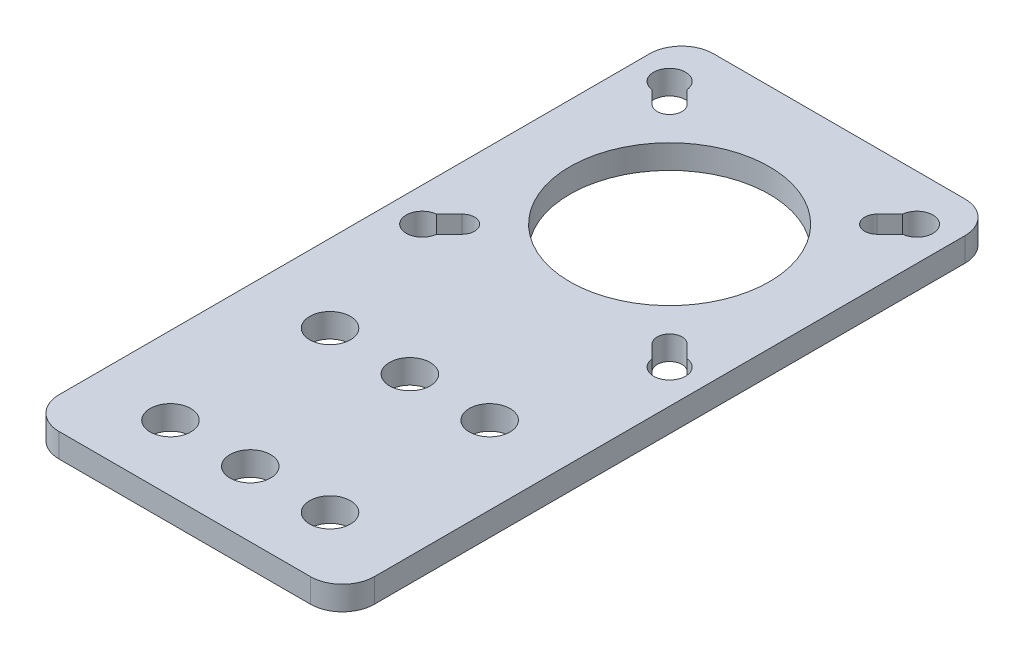
ISO-10303-21;
HEADER;
FILE_DESCRIPTION(('STEP AP214'),'2;1');
FILE_NAME('part.step','',(''),(''),'','','');
FILE_SCHEMA(('AUTOMOTIVE_DESIGN { 1 0 10303 214 1 1 1 1 }'));
ENDSEC;
DATA;
#1=APPLICATION_CONTEXT('core data for automotive mechanical design processes');
#2=APPLICATION_PROTOCOL_DEFINITION('international standard','automotive_design',2000,#1);
#3=PRODUCT_CONTEXT('',#1,'mechanical');
#4=PRODUCT('Part','Part','',(#3));
#5=PRODUCT_RELATED_PRODUCT_CATEGORY('part','',(#4));
#6=PRODUCT_DEFINITION_FORMATION('','',#4);
#7=PRODUCT_DEFINITION_CONTEXT('part definition',#1,'design');
#8=PRODUCT_DEFINITION('design','',#6,#7);
#9=PRODUCT_DEFINITION_SHAPE('','',#8);
#10=(LENGTH_UNIT() NAMED_UNIT(*) SI_UNIT(.MILLI.,.METRE.));
#11=(NAMED_UNIT(*) PLANE_ANGLE_UNIT() SI_UNIT($,.RADIAN.));
#12=(NAMED_UNIT(*) SI_UNIT($,.STERADIAN.) SOLID_ANGLE_UNIT());
#13=UNCERTAINTY_MEASURE_WITH_UNIT(LENGTH_MEASURE(1.E-05),#10,'distance_accuracy_value','');
#14=(GEOMETRIC_REPRESENTATION_CONTEXT(3) GLOBAL_UNCERTAINTY_ASSIGNED_CONTEXT((#13)) GLOBAL_UNIT_ASSIGNED_CONTEXT((#10,
#11,#12)) REPRESENTATION_CONTEXT('',''));
#15=CARTESIAN_POINT('',(0.,0.,0.));
#16=DIRECTION('',(0.,0.,1.));
#17=DIRECTION('',(1.,0.,0.));
#18=AXIS2_PLACEMENT_3D('',#15,#16,#17);
#19=CARTESIAN_POINT('',(-15.75,3.,56.75));
#20=DIRECTION('',(0.,-1.,0.));
#21=DIRECTION('',(0.,0.,-1.));
#22=AXIS2_PLACEMENT_3D('',#19,#20,#21);
#23=PLANE('',#22);
#24=DIRECTION('',(0.707106781186545,0.,-0.70710678118655));
#25=VECTOR('',#24,1.);
#26=CARTESIAN_POINT('',(-11.9039844891608,3.,14.0960155108391));
#27=LINE('',#26,#25);
#28=CARTESIAN_POINT('',(-13.5102563425748,3.,15.7022873642532));
#29=VERTEX_POINT('',#28);
#30=CARTESIAN_POINT('',(-11.9039844891608,3.,14.0960155108391));
#31=VERTEX_POINT('',#30);
#32=EDGE_CURVE('E248',#29,#31,#27,.T.);
#33=ORIENTED_EDGE('',*,*,#32,.F.);
#34=CARTESIAN_POINT('',(-15.4999999999999,3.,15.5));
#35=DIRECTION('',(0.,1.,0.));
#36=DIRECTION('',(0.,0.,1.));
#37=AXIS2_PLACEMENT_3D('',#34,#35,#36);
#38=CIRCLE('',#37,2.);
#39=CARTESIAN_POINT('',(-15.7022873642531,3.,13.5102563425749));
#40=VERTEX_POINT('',#39);
#41=EDGE_CURVE('E68',#40,#29,#38,.T.);
#42=ORIENTED_EDGE('',*,*,#41,.F.);
#43=DIRECTION('',(-0.707106781186545,0.,0.70710678118655));
#44=VECTOR('',#43,1.);
#45=CARTESIAN_POINT('',(-14.0960155108391,3.,11.9039844891609));
#46=LINE('',#45,#44);
#47=CARTESIAN_POINT('',(-14.0960155108391,3.,11.9039844891609));
#48=VERTEX_POINT('',#47);
#49=EDGE_CURVE('E244',#48,#40,#46,.T.);
#50=ORIENTED_EDGE('',*,*,#49,.F.);
#51=CARTESIAN_POINT('',(-12.9999999999999,3.,13.));
#52=DIRECTION('',(0.,1.,0.));
#53=DIRECTION('',(0.,0.,1.));
#54=AXIS2_PLACEMENT_3D('',#51,#52,#53);
#55=CIRCLE('',#54,1.55);
#56=EDGE_CURVE('E242',#31,#48,#55,.T.);
#57=ORIENTED_EDGE('',*,*,#56,.F.);
#58=EDGE_LOOP('',(#33,#42,#50,#57));
#59=FACE_BOUND('',#58,.T.);
#60=CARTESIAN_POINT('',(-9.99999999999999,3.,32.55));
#61=DIRECTION('',(0.,1.,0.));
#62=DIRECTION('',(0.,0.,1.));
#63=AXIS2_PLACEMENT_3D('',#60,#61,#62);
#64=CIRCLE('',#63,2.55);
#65=CARTESIAN_POINT('',(-9.99999999999999,3.,35.1));
#66=VERTEX_POINT('',#65);
#67=EDGE_CURVE('E284',#66,#66,#64,.T.);
#68=ORIENTED_EDGE('',*,*,#67,.F.);
#69=EDGE_LOOP('',(#68));
#70=FACE_BOUND('',#69,.T.);
#71=CARTESIAN_POINT('',(0.,3.,32.55));
#72=DIRECTION('',(0.,1.,0.));
#73=DIRECTION('',(0.,0.,1.));
#74=AXIS2_PLACEMENT_3D('',#71,#72,#73);
#75=CIRCLE('',#74,2.55);
#76=CARTESIAN_POINT('',(0.,3.,35.1));
#77=VERTEX_POINT('',#76);
#78=EDGE_CURVE('E296',#77,#77,#75,.T.);
#79=ORIENTED_EDGE('',*,*,#78,.F.);
#80=EDGE_LOOP('',(#79));
#81=FACE_BOUND('',#80,.T.);
#82=CARTESIAN_POINT('',(10.,3.,32.55));
#83=DIRECTION('',(0.,1.,0.));
#84=DIRECTION('',(0.,0.,1.));
#85=AXIS2_PLACEMENT_3D('',#82,#83,#84);
#86=CIRCLE('',#85,2.55);
#87=CARTESIAN_POINT('',(10.,3.,35.1));
#88=VERTEX_POINT('',#87);
#89=EDGE_CURVE('E308',#88,#88,#86,.T.);
#90=ORIENTED_EDGE('',*,*,#89,.F.);
#91=EDGE_LOOP('',(#90));
#92=FACE_BOUND('',#91,.T.);
#93=DIRECTION('',(-0.707106781186545,0.,0.70710678118655));
#94=VECTOR('',#93,1.);
#95=CARTESIAN_POINT('',(11.9039844891608,3.,-14.0960155108391));
#96=LINE('',#95,#94);
#97=CARTESIAN_POINT('',(13.5102563425748,3.,-15.7022873642532));
#98=VERTEX_POINT('',#97);
#99=CARTESIAN_POINT('',(11.9039844891608,3.,-14.0960155108391));
#100=VERTEX_POINT('',#99);
#101=EDGE_CURVE('E326',#98,#100,#96,.T.);
#102=ORIENTED_EDGE('',*,*,#101,.F.);
#103=CARTESIAN_POINT('',(15.4999999999999,3.,-15.5));
#104=DIRECTION('',(0.,1.,0.));
#105=DIRECTION('',(0.,0.,1.));
#106=AXIS2_PLACEMENT_3D('',#103,#104,#105);
#107=CIRCLE('',#106,2.);
#108=CARTESIAN_POINT('',(15.7022873642531,3.,-13.5102563425749));
#109=VERTEX_POINT('',#108);
#110=EDGE_CURVE('E431',#109,#98,#107,.T.);
#111=ORIENTED_EDGE('',*,*,#110,.F.);
#112=DIRECTION('',(0.707106781186546,0.,-0.707106781186549));
#113=VECTOR('',#112,1.);
#114=CARTESIAN_POINT('',(14.0960155108391,3.,-11.9039844891608));
#115=LINE('',#114,#113);
#116=CARTESIAN_POINT('',(14.0960155108391,3.,-11.9039844891608));
#117=VERTEX_POINT('',#116);
#118=EDGE_CURVE('E322',#117,#109,#115,.T.);
#119=ORIENTED_EDGE('',*,*,#118,.F.);
#120=CARTESIAN_POINT('',(12.9999999999999,3.,-13.));
#121=DIRECTION('',(0.,1.,0.));
#122=DIRECTION('',(0.,0.,1.));
#123=AXIS2_PLACEMENT_3D('',#120,#121,#122);
#124=CIRCLE('',#123,1.55);
#125=EDGE_CURVE('E320',#100,#117,#124,.T.);
#126=ORIENTED_EDGE('',*,*,#125,.F.);
#127=EDGE_LOOP('',(#102,#111,#119,#126));
#128=FACE_BOUND('',#127,.T.);
#129=CARTESIAN_POINT('',(-15.75,3.,56.75));
#130=DIRECTION('',(0.,1.,0.));
#131=DIRECTION('',(0.,0.,-1.));
#132=AXIS2_PLACEMENT_3D('',#129,#130,#131);
#133=CIRCLE('',#132,4.00000000000001);
#134=CARTESIAN_POINT('',(-19.75,3.,56.75));
#135=VERTEX_POINT('',#134);
#136=CARTESIAN_POINT('',(-15.75,3.,60.75));
#137=VERTEX_POINT('',#136);
#138=EDGE_CURVE('E347',#135,#137,#133,.T.);
#139=ORIENTED_EDGE('',*,*,#138,.T.);
#140=DIRECTION('',(1.,0.,0.));
#141=VECTOR('',#140,1.);
#142=CARTESIAN_POINT('',(15.75,3.,60.75));
#143=LINE('',#142,#141);
#144=CARTESIAN_POINT('',(15.75,3.,60.75));
#145=VERTEX_POINT('',#144);
#146=EDGE_CURVE('E350',#137,#145,#143,.T.);
#147=ORIENTED_EDGE('',*,*,#146,.T.);
#148=CARTESIAN_POINT('',(15.75,3.,56.75));
#149=DIRECTION('',(0.,1.,0.));
#150=DIRECTION('',(0.,0.,1.));
#151=AXIS2_PLACEMENT_3D('',#148,#149,#150);
#152=CIRCLE('',#151,4.00000000000001);
#153=CARTESIAN_POINT('',(19.75,3.,56.75));
#154=VERTEX_POINT('',#153);
#155=EDGE_CURVE('E353',#145,#154,#152,.T.);
#156=ORIENTED_EDGE('',*,*,#155,.T.);
#157=DIRECTION('',(0.,0.,-1.));
#158=VECTOR('',#157,1.);
#159=CARTESIAN_POINT('',(19.75,3.,56.75));
#160=LINE('',#159,#158);
#161=CARTESIAN_POINT('',(19.75,3.,-17.25));
#162=VERTEX_POINT('',#161);
#163=EDGE_CURVE('E355',#154,#162,#160,.T.);
#164=ORIENTED_EDGE('',*,*,#163,.T.);
#165=CARTESIAN_POINT('',(15.75,3.,-17.25));
#166=DIRECTION('',(0.,1.,0.));
#167=DIRECTION('',(0.,0.,1.));
#168=AXIS2_PLACEMENT_3D('',#165,#166,#167);
#169=CIRCLE('',#168,4.);
#170=CARTESIAN_POINT('',(15.75,3.,-21.25));
#171=VERTEX_POINT('',#170);
#172=EDGE_CURVE('E357',#162,#171,#169,.T.);
#173=ORIENTED_EDGE('',*,*,#172,.T.);
#174=DIRECTION('',(-1.,0.,0.));
#175=VECTOR('',#174,1.);
#176=CARTESIAN_POINT('',(15.75,3.,-21.25));
#177=LINE('',#176,#175);
#178=CARTESIAN_POINT('',(-15.75,3.,-21.25));
#179=VERTEX_POINT('',#178);
#180=EDGE_CURVE('E359',#171,#179,#177,.T.);
#181=ORIENTED_EDGE('',*,*,#180,.T.);
#182=CARTESIAN_POINT('',(-15.75,3.,-17.25));
#183=DIRECTION('',(0.,1.,0.));
#184=DIRECTION('',(0.,0.,1.));
#185=AXIS2_PLACEMENT_3D('',#182,#183,#184);
#186=CIRCLE('',#185,4.);
#187=CARTESIAN_POINT('',(-19.75,3.,-17.25));
#188=VERTEX_POINT('',#187);
#189=EDGE_CURVE('E361',#179,#188,#186,.T.);
#190=ORIENTED_EDGE('',*,*,#189,.T.);
#191=DIRECTION('',(0.,0.,1.));
#192=VECTOR('',#191,1.);
#193=CARTESIAN_POINT('',(-19.75,3.,56.75));
#194=LINE('',#193,#192);
#195=EDGE_CURVE('E363',#188,#135,#194,.T.);
#196=ORIENTED_EDGE('',*,*,#195,.T.);
#197=EDGE_LOOP('',(#139,#147,#156,#164,#173,#181,#190,#196));
#198=FACE_BOUND('',#197,.T.);
#199=CARTESIAN_POINT('',(0.,3.,0.));
#200=DIRECTION('',(0.,1.,0.));
#201=DIRECTION('',(0.,0.,1.));
#202=AXIS2_PLACEMENT_3D('',#199,#200,#201);
#203=CIRCLE('',#202,12.5);
#204=CARTESIAN_POINT('',(0.,3.,12.5));
#205=VERTEX_POINT('',#204);
#206=EDGE_CURVE('E341',#205,#205,#203,.T.);
#207=ORIENTED_EDGE('',*,*,#206,.F.);
#208=EDGE_LOOP('',(#207));
#209=FACE_BOUND('',#208,.T.);
#210=CARTESIAN_POINT('',(10.,3.,52.55));
#211=DIRECTION('',(0.,1.,0.));
#212=DIRECTION('',(0.,0.,1.));
#213=AXIS2_PLACEMENT_3D('',#210,#211,#212);
#214=CIRCLE('',#213,2.55);
#215=CARTESIAN_POINT('',(10.,3.,55.1));
#216=VERTEX_POINT('',#215);
#217=EDGE_CURVE('E314',#216,#216,#214,.T.);
#218=ORIENTED_EDGE('',*,*,#217,.F.);
#219=EDGE_LOOP('',(#218));
#220=FACE_BOUND('',#219,.T.);
#221=CARTESIAN_POINT('',(0.,3.,52.55));
#222=DIRECTION('',(0.,1.,0.));
#223=DIRECTION('',(0.,0.,1.));
#224=AXIS2_PLACEMENT_3D('',#221,#222,#223);
#225=CIRCLE('',#224,2.55);
#226=CARTESIAN_POINT('',(0.,3.,55.1));
#227=VERTEX_POINT('',#226);
#228=EDGE_CURVE('E302',#227,#227,#225,.T.);
#229=ORIENTED_EDGE('',*,*,#228,.F.);
#230=EDGE_LOOP('',(#229));
#231=FACE_BOUND('',#230,.T.);
#232=CARTESIAN_POINT('',(-9.99999999999999,3.,52.55));
#233=DIRECTION('',(0.,1.,0.));
#234=DIRECTION('',(0.,0.,1.));
#235=AXIS2_PLACEMENT_3D('',#232,#233,#234);
#236=CIRCLE('',#235,2.55);
#237=CARTESIAN_POINT('',(-9.99999999999999,3.,55.1));
#238=VERTEX_POINT('',#237);
#239=EDGE_CURVE('E290',#238,#238,#236,.T.);
#240=ORIENTED_EDGE('',*,*,#239,.F.);
#241=EDGE_LOOP('',(#240));
#242=FACE_BOUND('',#241,.T.);
#243=DIRECTION('',(0.707106781186545,0.,0.70710678118655));
#244=VECTOR('',#243,1.);
#245=CARTESIAN_POINT('',(-14.0960155108391,3.,-11.9039844891609));
#246=LINE('',#245,#244);
#247=CARTESIAN_POINT('',(-15.7022873642531,3.,-13.5102563425749));
#248=VERTEX_POINT('',#247);
#249=CARTESIAN_POINT('',(-14.0960155108391,3.,-11.9039844891609));
#250=VERTEX_POINT('',#249);
#251=EDGE_CURVE('E269',#248,#250,#246,.T.);
#252=ORIENTED_EDGE('',*,*,#251,.F.);
#253=CARTESIAN_POINT('',(-15.4999999999999,3.,-15.5));
#254=DIRECTION('',(0.,1.,0.));
#255=DIRECTION('',(0.,0.,1.));
#256=AXIS2_PLACEMENT_3D('',#253,#254,#255);
#257=CIRCLE('',#256,2.);
#258=CARTESIAN_POINT('',(-13.5102563425748,3.,-15.7022873642532));
#259=VERTEX_POINT('',#258);
#260=EDGE_CURVE('E440',#259,#248,#257,.T.);
#261=ORIENTED_EDGE('',*,*,#260,.F.);
#262=DIRECTION('',(-0.707106781186545,0.,-0.70710678118655));
#263=VECTOR('',#262,1.);
#264=CARTESIAN_POINT('',(-11.9039844891608,3.,-14.0960155108391));
#265=LINE('',#264,#263);
#266=CARTESIAN_POINT('',(-11.9039844891608,3.,-14.0960155108391));
#267=VERTEX_POINT('',#266);
#268=EDGE_CURVE('E265',#267,#259,#265,.T.);
#269=ORIENTED_EDGE('',*,*,#268,.F.);
#270=CARTESIAN_POINT('',(-12.9999999999999,3.,-13.));
#271=DIRECTION('',(0.,1.,0.));
#272=DIRECTION('',(0.,0.,-1.));
#273=AXIS2_PLACEMENT_3D('',#270,#271,#272);
#274=CIRCLE('',#273,1.55);
#275=EDGE_CURVE('E263',#250,#267,#274,.T.);
#276=ORIENTED_EDGE('',*,*,#275,.F.);
#277=EDGE_LOOP('',(#252,#261,#269,#276));
#278=FACE_BOUND('',#277,.T.);
#279=DIRECTION('',(-0.707106781186546,0.,-0.707106781186549));
#280=VECTOR('',#279,1.);
#281=CARTESIAN_POINT('',(14.0960155108391,3.,11.9039844891608));
#282=LINE('',#281,#280);
#283=CARTESIAN_POINT('',(15.7022873642531,3.,13.5102563425749));
#284=VERTEX_POINT('',#283);
#285=CARTESIAN_POINT('',(14.0960155108391,3.,11.9039844891608));
#286=VERTEX_POINT('',#285);
#287=EDGE_CURVE('E217',#284,#286,#282,.T.);
#288=ORIENTED_EDGE('',*,*,#287,.F.);
#289=CARTESIAN_POINT('',(15.4999999999999,3.,15.5));
#290=DIRECTION('',(0.,1.,0.));
#291=DIRECTION('',(0.,0.,1.));
#292=AXIS2_PLACEMENT_3D('',#289,#290,#291);
#293=CIRCLE('',#292,2.);
#294=CARTESIAN_POINT('',(13.5102563425748,3.,15.7022873642532));
#295=VERTEX_POINT('',#294);
#296=EDGE_CURVE('E60',#295,#284,#293,.T.);
#297=ORIENTED_EDGE('',*,*,#296,.F.);
#298=DIRECTION('',(0.707106781186545,0.,0.70710678118655));
#299=VECTOR('',#298,1.);
#300=CARTESIAN_POINT('',(11.9039844891608,3.,14.0960155108391));
#301=LINE('',#300,#299);
#302=CARTESIAN_POINT('',(11.9039844891608,3.,14.0960155108391));
#303=VERTEX_POINT('',#302);
#304=EDGE_CURVE('E216',#303,#295,#301,.T.);
#305=ORIENTED_EDGE('',*,*,#304,.F.);
#306=CARTESIAN_POINT('',(12.9999999999999,3.,13.));
#307=DIRECTION('',(0.,1.,0.));
#308=DIRECTION('',(0.,0.,-1.));
#309=AXIS2_PLACEMENT_3D('',#306,#307,#308);
#310=CIRCLE('',#309,1.55);
#311=EDGE_CURVE('E223',#286,#303,#310,.T.);
#312=ORIENTED_EDGE('',*,*,#311,.F.);
#313=EDGE_LOOP('',(#288,#297,#305,#312));
#314=FACE_BOUND('',#313,.T.);
#315=ADVANCED_FACE('F46',(#59,#70,#81,#92,#128,#198,#209,#220,#231,#242,#278,#314),#23,.F.);
#316=CARTESIAN_POINT('',(-15.75,0.,56.75));
#317=DIRECTION('',(0.,-1.,0.));
#318=DIRECTION('',(0.,0.,-1.));
#319=AXIS2_PLACEMENT_3D('',#316,#317,#318);
#320=PLANE('',#319);
#321=CARTESIAN_POINT('',(15.4999999999999,0.,15.5));
#322=DIRECTION('',(0.,-1.,0.));
#323=DIRECTION('',(0.,0.,-1.));
#324=AXIS2_PLACEMENT_3D('',#321,#322,#323);
#325=CIRCLE('',#324,2.);
#326=CARTESIAN_POINT('',(15.7022873642531,0.,13.5102563425749));
#327=VERTEX_POINT('',#326);
#328=CARTESIAN_POINT('',(13.5102563425748,0.,15.7022873642532));
#329=VERTEX_POINT('',#328);
#330=EDGE_CURVE('E207',#327,#329,#325,.T.);
#331=ORIENTED_EDGE('',*,*,#330,.F.);
#332=DIRECTION('',(-0.707106781186546,0.,-0.707106781186549));
#333=VECTOR('',#332,1.);
#334=CARTESIAN_POINT('',(14.0960155108391,0.,11.9039844891608));
#335=LINE('',#334,#333);
#336=CARTESIAN_POINT('',(14.0960155108391,0.,11.9039844891608));
#337=VERTEX_POINT('',#336);
#338=EDGE_CURVE('E227',#327,#337,#335,.T.);
#339=ORIENTED_EDGE('',*,*,#338,.T.);
#340=CARTESIAN_POINT('',(12.9999999999999,0.,13.));
#341=DIRECTION('',(0.,1.,0.));
#342=DIRECTION('',(0.,0.,-1.));
#343=AXIS2_PLACEMENT_3D('',#340,#341,#342);
#344=CIRCLE('',#343,1.55);
#345=CARTESIAN_POINT('',(11.9039844891608,0.,14.0960155108391));
#346=VERTEX_POINT('',#345);
#347=EDGE_CURVE('E231',#337,#346,#344,.T.);
#348=ORIENTED_EDGE('',*,*,#347,.T.);
#349=DIRECTION('',(0.707106781186545,0.,0.70710678118655));
#350=VECTOR('',#349,1.);
#351=CARTESIAN_POINT('',(11.9039844891608,0.,14.0960155108391));
#352=LINE('',#351,#350);
#353=EDGE_CURVE('E234',#346,#329,#352,.T.);
#354=ORIENTED_EDGE('',*,*,#353,.T.);
#355=EDGE_LOOP('',(#331,#339,#348,#354));
#356=FACE_BOUND('',#355,.T.);
#357=CARTESIAN_POINT('',(-15.4999999999999,0.,15.5));
#358=DIRECTION('',(0.,-1.,0.));
#359=DIRECTION('',(0.,0.,-1.));
#360=AXIS2_PLACEMENT_3D('',#357,#358,#359);
#361=CIRCLE('',#360,2.);
#362=CARTESIAN_POINT('',(-13.5102563425748,0.,15.7022873642532));
#363=VERTEX_POINT('',#362);
#364=CARTESIAN_POINT('',(-15.7022873642531,0.,13.5102563425749));
#365=VERTEX_POINT('',#364);
#366=EDGE_CURVE('E409',#363,#365,#361,.T.);
#367=ORIENTED_EDGE('',*,*,#366,.F.);
#368=DIRECTION('',(0.707106781186545,0.,-0.70710678118655));
#369=VECTOR('',#368,1.);
#370=CARTESIAN_POINT('',(-11.9039844891608,0.,14.0960155108391));
#371=LINE('',#370,#369);
#372=CARTESIAN_POINT('',(-11.9039844891608,0.,14.0960155108391));
#373=VERTEX_POINT('',#372);
#374=EDGE_CURVE('E245',#363,#373,#371,.T.);
#375=ORIENTED_EDGE('',*,*,#374,.T.);
#376=CARTESIAN_POINT('',(-12.9999999999999,0.,13.));
#377=DIRECTION('',(0.,1.,0.));
#378=DIRECTION('',(0.,0.,1.));
#379=AXIS2_PLACEMENT_3D('',#376,#377,#378);
#380=CIRCLE('',#379,1.55);
#381=CARTESIAN_POINT('',(-14.0960155108391,0.,11.9039844891609));
#382=VERTEX_POINT('',#381);
#383=EDGE_CURVE('E241',#373,#382,#380,.T.);
#384=ORIENTED_EDGE('',*,*,#383,.T.);
#385=DIRECTION('',(-0.707106781186545,0.,0.70710678118655));
#386=VECTOR('',#385,1.);
#387=CARTESIAN_POINT('',(-14.0960155108391,0.,11.9039844891609));
#388=LINE('',#387,#386);
#389=EDGE_CURVE('E253',#382,#365,#388,.T.);
#390=ORIENTED_EDGE('',*,*,#389,.T.);
#391=EDGE_LOOP('',(#367,#375,#384,#390));
#392=FACE_BOUND('',#391,.T.);
#393=CARTESIAN_POINT('',(15.4999999999999,0.,-15.5));
#394=DIRECTION('',(0.,-1.,0.));
#395=DIRECTION('',(0.,0.,-1.));
#396=AXIS2_PLACEMENT_3D('',#393,#394,#395);
#397=CIRCLE('',#396,2.);
#398=CARTESIAN_POINT('',(13.5102563425748,0.,-15.7022873642532));
#399=VERTEX_POINT('',#398);
#400=CARTESIAN_POINT('',(15.7022873642531,0.,-13.5102563425749));
#401=VERTEX_POINT('',#400);
#402=EDGE_CURVE('E433',#399,#401,#397,.T.);
#403=ORIENTED_EDGE('',*,*,#402,.F.);
#404=DIRECTION('',(-0.707106781186545,0.,0.70710678118655));
#405=VECTOR('',#404,1.);
#406=CARTESIAN_POINT('',(11.9039844891608,0.,-14.0960155108391));
#407=LINE('',#406,#405);
#408=CARTESIAN_POINT('',(11.9039844891608,0.,-14.0960155108391));
#409=VERTEX_POINT('',#408);
#410=EDGE_CURVE('E323',#399,#409,#407,.T.);
#411=ORIENTED_EDGE('',*,*,#410,.T.);
#412=CARTESIAN_POINT('',(12.9999999999999,0.,-13.));
#413=DIRECTION('',(0.,1.,0.));
#414=DIRECTION('',(0.,0.,1.));
#415=AXIS2_PLACEMENT_3D('',#412,#413,#414);
#416=CIRCLE('',#415,1.55);
#417=CARTESIAN_POINT('',(14.0960155108391,0.,-11.9039844891608));
#418=VERTEX_POINT('',#417);
#419=EDGE_CURVE('E317',#409,#418,#416,.T.);
#420=ORIENTED_EDGE('',*,*,#419,.T.);
#421=DIRECTION('',(0.707106781186546,0.,-0.707106781186549));
#422=VECTOR('',#421,1.);
#423=CARTESIAN_POINT('',(14.0960155108391,0.,-11.9039844891608));
#424=LINE('',#423,#422);
#425=EDGE_CURVE('E331',#418,#401,#424,.T.);
#426=ORIENTED_EDGE('',*,*,#425,.T.);
#427=EDGE_LOOP('',(#403,#411,#420,#426));
#428=FACE_BOUND('',#427,.T.);
#429=CARTESIAN_POINT('',(-15.4999999999999,0.,-15.5));
#430=DIRECTION('',(0.,-1.,0.));
#431=DIRECTION('',(0.,0.,-1.));
#432=AXIS2_PLACEMENT_3D('',#429,#430,#431);
#433=CIRCLE('',#432,2.);
#434=CARTESIAN_POINT('',(-15.7022873642531,0.,-13.5102563425749));
#435=VERTEX_POINT('',#434);
#436=CARTESIAN_POINT('',(-13.5102563425748,0.,-15.7022873642532));
#437=VERTEX_POINT('',#436);
#438=EDGE_CURVE('E442',#435,#437,#433,.T.);
#439=ORIENTED_EDGE('',*,*,#438,.F.);
#440=DIRECTION('',(0.707106781186545,0.,0.70710678118655));
#441=VECTOR('',#440,1.);
#442=CARTESIAN_POINT('',(-14.0960155108391,0.,-11.9039844891609));
#443=LINE('',#442,#441);
#444=CARTESIAN_POINT('',(-14.0960155108391,0.,-11.9039844891609));
#445=VERTEX_POINT('',#444);
#446=EDGE_CURVE('E266',#435,#445,#443,.T.);
#447=ORIENTED_EDGE('',*,*,#446,.T.);
#448=CARTESIAN_POINT('',(-12.9999999999999,0.,-13.));
#449=DIRECTION('',(0.,1.,0.));
#450=DIRECTION('',(0.,0.,-1.));
#451=AXIS2_PLACEMENT_3D('',#448,#449,#450);
#452=CIRCLE('',#451,1.55);
#453=CARTESIAN_POINT('',(-11.9039844891608,0.,-14.0960155108391));
#454=VERTEX_POINT('',#453);
#455=EDGE_CURVE('E262',#445,#454,#452,.T.);
#456=ORIENTED_EDGE('',*,*,#455,.T.);
#457=DIRECTION('',(-0.707106781186545,0.,-0.70710678118655));
#458=VECTOR('',#457,1.);
#459=CARTESIAN_POINT('',(-11.9039844891608,0.,-14.0960155108391));
#460=LINE('',#459,#458);
#461=EDGE_CURVE('E274',#454,#437,#460,.T.);
#462=ORIENTED_EDGE('',*,*,#461,.T.);
#463=EDGE_LOOP('',(#439,#447,#456,#462));
#464=FACE_BOUND('',#463,.T.);
#465=CARTESIAN_POINT('',(-9.99999999999999,0.,32.55));
#466=DIRECTION('',(0.,1.,0.));
#467=DIRECTION('',(0.,0.,1.));
#468=AXIS2_PLACEMENT_3D('',#465,#466,#467);
#469=CIRCLE('',#468,2.55);
#470=CARTESIAN_POINT('',(-9.99999999999999,0.,35.1));
#471=VERTEX_POINT('',#470);
#472=EDGE_CURVE('E283',#471,#471,#469,.T.);
#473=ORIENTED_EDGE('',*,*,#472,.T.);
#474=EDGE_LOOP('',(#473));
#475=FACE_BOUND('',#474,.T.);
#476=CARTESIAN_POINT('',(0.,0.,32.55));
#477=DIRECTION('',(0.,1.,0.));
#478=DIRECTION('',(0.,0.,1.));
#479=AXIS2_PLACEMENT_3D('',#476,#477,#478);
#480=CIRCLE('',#479,2.55);
#481=CARTESIAN_POINT('',(0.,0.,35.1));
#482=VERTEX_POINT('',#481);
#483=EDGE_CURVE('E293',#482,#482,#480,.T.);
#484=ORIENTED_EDGE('',*,*,#483,.T.);
#485=EDGE_LOOP('',(#484));
#486=FACE_BOUND('',#485,.T.);
#487=CARTESIAN_POINT('',(10.,0.,32.55));
#488=DIRECTION('',(0.,1.,0.));
#489=DIRECTION('',(0.,0.,1.));
#490=AXIS2_PLACEMENT_3D('',#487,#488,#489);
#491=CIRCLE('',#490,2.55);
#492=CARTESIAN_POINT('',(10.,0.,35.1));
#493=VERTEX_POINT('',#492);
#494=EDGE_CURVE('E305',#493,#493,#491,.T.);
#495=ORIENTED_EDGE('',*,*,#494,.T.);
#496=EDGE_LOOP('',(#495));
#497=FACE_BOUND('',#496,.T.);
#498=CARTESIAN_POINT('',(-15.75,0.,56.75));
#499=DIRECTION('',(0.,1.,0.));
#500=DIRECTION('',(0.,0.,-1.));
#501=AXIS2_PLACEMENT_3D('',#498,#499,#500);
#502=CIRCLE('',#501,4.00000000000001);
#503=CARTESIAN_POINT('',(-19.75,0.,56.75));
#504=VERTEX_POINT('',#503);
#505=CARTESIAN_POINT('',(-15.75,0.,60.75));
#506=VERTEX_POINT('',#505);
#507=EDGE_CURVE('E344',#504,#506,#502,.T.);
#508=ORIENTED_EDGE('',*,*,#507,.F.);
#509=DIRECTION('',(0.,0.,1.));
#510=VECTOR('',#509,1.);
#511=CARTESIAN_POINT('',(-19.75,0.,56.75));
#512=LINE('',#511,#510);
#513=CARTESIAN_POINT('',(-19.75,0.,-17.25));
#514=VERTEX_POINT('',#513);
#515=EDGE_CURVE('E351',#514,#504,#512,.T.);
#516=ORIENTED_EDGE('',*,*,#515,.F.);
#517=CARTESIAN_POINT('',(-15.75,0.,-17.25));
#518=DIRECTION('',(0.,1.,0.));
#519=DIRECTION('',(0.,0.,1.));
#520=AXIS2_PLACEMENT_3D('',#517,#518,#519);
#521=CIRCLE('',#520,4.);
#522=CARTESIAN_POINT('',(-15.75,0.,-21.25));
#523=VERTEX_POINT('',#522);
#524=EDGE_CURVE('E378',#523,#514,#521,.T.);
#525=ORIENTED_EDGE('',*,*,#524,.F.);
#526=DIRECTION('',(-1.,0.,0.));
#527=VECTOR('',#526,1.);
#528=CARTESIAN_POINT('',(15.75,0.,-21.25));
#529=LINE('',#528,#527);
#530=CARTESIAN_POINT('',(15.75,0.,-21.25));
#531=VERTEX_POINT('',#530);
#532=EDGE_CURVE('E376',#531,#523,#529,.T.);
#533=ORIENTED_EDGE('',*,*,#532,.F.);
#534=CARTESIAN_POINT('',(15.75,0.,-17.25));
#535=DIRECTION('',(0.,1.,0.));
#536=DIRECTION('',(0.,0.,1.));
#537=AXIS2_PLACEMENT_3D('',#534,#535,#536);
#538=CIRCLE('',#537,4.);
#539=CARTESIAN_POINT('',(19.75,0.,-17.25));
#540=VERTEX_POINT('',#539);
#541=EDGE_CURVE('E374',#540,#531,#538,.T.);
#542=ORIENTED_EDGE('',*,*,#541,.F.);
#543=DIRECTION('',(0.,0.,-1.));
#544=VECTOR('',#543,1.);
#545=CARTESIAN_POINT('',(19.75,0.,56.75));
#546=LINE('',#545,#544);
#547=CARTESIAN_POINT('',(19.75,0.,56.75));
#548=VERTEX_POINT('',#547);
#549=EDGE_CURVE('E372',#548,#540,#546,.T.);
#550=ORIENTED_EDGE('',*,*,#549,.F.);
#551=CARTESIAN_POINT('',(15.75,0.,56.75));
#552=DIRECTION('',(0.,1.,0.));
#553=DIRECTION('',(0.,0.,1.));
#554=AXIS2_PLACEMENT_3D('',#551,#552,#553);
#555=CIRCLE('',#554,4.00000000000001);
#556=CARTESIAN_POINT('',(15.75,0.,60.75));
#557=VERTEX_POINT('',#556);
#558=EDGE_CURVE('E370',#557,#548,#555,.T.);
#559=ORIENTED_EDGE('',*,*,#558,.F.);
#560=DIRECTION('',(1.,0.,0.));
#561=VECTOR('',#560,1.);
#562=CARTESIAN_POINT('',(15.75,0.,60.75));
#563=LINE('',#562,#561);
#564=EDGE_CURVE('E368',#506,#557,#563,.T.);
#565=ORIENTED_EDGE('',*,*,#564,.F.);
#566=EDGE_LOOP('',(#508,#516,#525,#533,#542,#550,#559,#565));
#567=FACE_BOUND('',#566,.T.);
#568=CARTESIAN_POINT('',(0.,0.,0.));
#569=DIRECTION('',(0.,1.,0.));
#570=DIRECTION('',(0.,0.,1.));
#571=AXIS2_PLACEMENT_3D('',#568,#569,#570);
#572=CIRCLE('',#571,12.5);
#573=CARTESIAN_POINT('',(0.,0.,12.5));
#574=VERTEX_POINT('',#573);
#575=EDGE_CURVE('E340',#574,#574,#572,.T.);
#576=ORIENTED_EDGE('',*,*,#575,.T.);
#577=EDGE_LOOP('',(#576));
#578=FACE_BOUND('',#577,.T.);
#579=CARTESIAN_POINT('',(10.,0.,52.55));
#580=DIRECTION('',(0.,1.,0.));
#581=DIRECTION('',(0.,0.,1.));
#582=AXIS2_PLACEMENT_3D('',#579,#580,#581);
#583=CIRCLE('',#582,2.55);
#584=CARTESIAN_POINT('',(10.,0.,55.1));
#585=VERTEX_POINT('',#584);
#586=EDGE_CURVE('E311',#585,#585,#583,.T.);
#587=ORIENTED_EDGE('',*,*,#586,.T.);
#588=EDGE_LOOP('',(#587));
#589=FACE_BOUND('',#588,.T.);
#590=CARTESIAN_POINT('',(0.,0.,52.55));
#591=DIRECTION('',(0.,1.,0.));
#592=DIRECTION('',(0.,0.,1.));
#593=AXIS2_PLACEMENT_3D('',#590,#591,#592);
#594=CIRCLE('',#593,2.55);
#595=CARTESIAN_POINT('',(0.,0.,55.1));
#596=VERTEX_POINT('',#595);
#597=EDGE_CURVE('E299',#596,#596,#594,.T.);
#598=ORIENTED_EDGE('',*,*,#597,.T.);
#599=EDGE_LOOP('',(#598));
#600=FACE_BOUND('',#599,.T.);
#601=CARTESIAN_POINT('',(-9.99999999999999,0.,52.55));
#602=DIRECTION('',(0.,1.,0.));
#603=DIRECTION('',(0.,0.,1.));
#604=AXIS2_PLACEMENT_3D('',#601,#602,#603);
#605=CIRCLE('',#604,2.55);
#606=CARTESIAN_POINT('',(-9.99999999999999,0.,55.1));
#607=VERTEX_POINT('',#606);
#608=EDGE_CURVE('E287',#607,#607,#605,.T.);
#609=ORIENTED_EDGE('',*,*,#608,.T.);
#610=EDGE_LOOP('',(#609));
#611=FACE_BOUND('',#610,.T.);
#612=ADVANCED_FACE('F415',(#356,#392,#428,#464,#475,#486,#497,#567,#578,#589,#600,#611),#320,.T.);
#613=CARTESIAN_POINT('',(-15.75,3.,56.75));
#614=DIRECTION('',(0.,-1.,0.));
#615=DIRECTION('',(0.,0.,-1.));
#616=AXIS2_PLACEMENT_3D('',#613,#614,#615);
#617=CYLINDRICAL_SURFACE('',#616,4.00000000000001);
#618=ORIENTED_EDGE('',*,*,#507,.T.);
#619=DIRECTION('',(0.,-1.,0.));
#620=VECTOR('',#619,1.);
#621=CARTESIAN_POINT('',(-15.75,3.,60.75));
#622=LINE('',#621,#620);
#623=EDGE_CURVE('E401',#137,#506,#622,.T.);
#624=ORIENTED_EDGE('',*,*,#623,.F.);
#625=ORIENTED_EDGE('',*,*,#138,.F.);
#626=DIRECTION('',(0.,-1.,0.));
#627=VECTOR('',#626,1.);
#628=CARTESIAN_POINT('',(-19.75,3.,56.75));
#629=LINE('',#628,#627);
#630=EDGE_CURVE('E365',#135,#504,#629,.T.);
#631=ORIENTED_EDGE('',*,*,#630,.T.);
#632=EDGE_LOOP('',(#618,#624,#625,#631));
#633=FACE_BOUND('',#632,.T.);
#634=ADVANCED_FACE('F48',(#633),#617,.T.);
#635=CARTESIAN_POINT('',(15.75,3.,60.75));
#636=DIRECTION('',(0.,0.,-1.));
#637=DIRECTION('',(-1.,0.,0.));
#638=AXIS2_PLACEMENT_3D('',#635,#636,#637);
#639=PLANE('',#638);
#640=ORIENTED_EDGE('',*,*,#564,.T.);
#641=DIRECTION('',(0.,-1.,0.));
#642=VECTOR('',#641,1.);
#643=CARTESIAN_POINT('',(15.75,3.,60.75));
#644=LINE('',#643,#642);
#645=EDGE_CURVE('E398',#145,#557,#644,.T.);
#646=ORIENTED_EDGE('',*,*,#645,.F.);
#647=ORIENTED_EDGE('',*,*,#146,.F.);
#648=ORIENTED_EDGE('',*,*,#623,.T.);
#649=EDGE_LOOP('',(#640,#646,#647,#648));
#650=FACE_BOUND('',#649,.T.);
#651=ADVANCED_FACE('F506',(#650),#639,.F.);
#652=CARTESIAN_POINT('',(15.75,3.,56.75));
#653=DIRECTION('',(0.,-1.,0.));
#654=DIRECTION('',(0.,0.,-1.));
#655=AXIS2_PLACEMENT_3D('',#652,#653,#654);
#656=CYLINDRICAL_SURFACE('',#655,4.00000000000001);
#657=ORIENTED_EDGE('',*,*,#558,.T.);
#658=DIRECTION('',(0.,-1.,0.));
#659=VECTOR('',#658,1.);
#660=CARTESIAN_POINT('',(19.75,3.,56.75));
#661=LINE('',#660,#659);
#662=EDGE_CURVE('E395',#154,#548,#661,.T.);
#663=ORIENTED_EDGE('',*,*,#662,.F.);
#664=ORIENTED_EDGE('',*,*,#155,.F.);
#665=ORIENTED_EDGE('',*,*,#645,.T.);
#666=EDGE_LOOP('',(#657,#663,#664,#665));
#667=FACE_BOUND('',#666,.T.);
#668=ADVANCED_FACE('F503',(#667),#656,.T.);
#669=CARTESIAN_POINT('',(19.75,3.,56.75));
#670=DIRECTION('',(-1.,0.,0.));
#671=DIRECTION('',(0.,0.,1.));
#672=AXIS2_PLACEMENT_3D('',#669,#670,#671);
#673=PLANE('',#672);
#674=ORIENTED_EDGE('',*,*,#549,.T.);
#675=DIRECTION('',(0.,-1.,0.));
#676=VECTOR('',#675,1.);
#677=CARTESIAN_POINT('',(19.75,3.,-17.25));
#678=LINE('',#677,#676);
#679=EDGE_CURVE('E392',#162,#540,#678,.T.);
#680=ORIENTED_EDGE('',*,*,#679,.F.);
#681=ORIENTED_EDGE('',*,*,#163,.F.);
#682=ORIENTED_EDGE('',*,*,#662,.T.);
#683=EDGE_LOOP('',(#674,#680,#681,#682));
#684=FACE_BOUND('',#683,.T.);
#685=ADVANCED_FACE('F499',(#684),#673,.F.);
#686=CARTESIAN_POINT('',(15.75,3.,-17.25));
#687=DIRECTION('',(0.,-1.,0.));
#688=DIRECTION('',(0.,0.,-1.));
#689=AXIS2_PLACEMENT_3D('',#686,#687,#688);
#690=CYLINDRICAL_SURFACE('',#689,4.);
#691=ORIENTED_EDGE('',*,*,#541,.T.);
#692=DIRECTION('',(0.,-1.,0.));
#693=VECTOR('',#692,1.);
#694=CARTESIAN_POINT('',(15.75,3.,-21.25));
#695=LINE('',#694,#693);
#696=EDGE_CURVE('E389',#171,#531,#695,.T.);
#697=ORIENTED_EDGE('',*,*,#696,.F.);
#698=ORIENTED_EDGE('',*,*,#172,.F.);
#699=ORIENTED_EDGE('',*,*,#679,.T.);
#700=EDGE_LOOP('',(#691,#697,#698,#699));
#701=FACE_BOUND('',#700,.T.);
#702=ADVANCED_FACE('F495',(#701),#690,.T.);
#703=CARTESIAN_POINT('',(15.75,3.,-21.25));
#704=DIRECTION('',(0.,0.,1.));
#705=DIRECTION('',(1.,0.,0.));
#706=AXIS2_PLACEMENT_3D('',#703,#704,#705);
#707=PLANE('',#706);
#708=ORIENTED_EDGE('',*,*,#532,.T.);
#709=DIRECTION('',(0.,-1.,0.));
#710=VECTOR('',#709,1.);
#711=CARTESIAN_POINT('',(-15.75,3.,-21.25));
#712=LINE('',#711,#710);
#713=EDGE_CURVE('E386',#179,#523,#712,.T.);
#714=ORIENTED_EDGE('',*,*,#713,.F.);
#715=ORIENTED_EDGE('',*,*,#180,.F.);
#716=ORIENTED_EDGE('',*,*,#696,.T.);
#717=EDGE_LOOP('',(#708,#714,#715,#716));
#718=FACE_BOUND('',#717,.T.);
#719=ADVANCED_FACE('F491',(#718),#707,.F.);
#720=CARTESIAN_POINT('',(-15.75,3.,-17.25));
#721=DIRECTION('',(0.,-1.,0.));
#722=DIRECTION('',(0.,0.,-1.));
#723=AXIS2_PLACEMENT_3D('',#720,#721,#722);
#724=CYLINDRICAL_SURFACE('',#723,4.);
#725=ORIENTED_EDGE('',*,*,#524,.T.);
#726=DIRECTION('',(0.,-1.,0.));
#727=VECTOR('',#726,1.);
#728=CARTESIAN_POINT('',(-19.75,3.,-17.25));
#729=LINE('',#728,#727);
#730=EDGE_CURVE('E383',#188,#514,#729,.T.);
#731=ORIENTED_EDGE('',*,*,#730,.F.);
#732=ORIENTED_EDGE('',*,*,#189,.F.);
#733=ORIENTED_EDGE('',*,*,#713,.T.);
#734=EDGE_LOOP('',(#725,#731,#732,#733));
#735=FACE_BOUND('',#734,.T.);
#736=ADVANCED_FACE('F487',(#735),#724,.T.);
#737=CARTESIAN_POINT('',(-19.75,3.,56.75));
#738=DIRECTION('',(1.,0.,0.));
#739=DIRECTION('',(0.,0.,-1.));
#740=AXIS2_PLACEMENT_3D('',#737,#738,#739);
#741=PLANE('',#740);
#742=ORIENTED_EDGE('',*,*,#515,.T.);
#743=ORIENTED_EDGE('',*,*,#630,.F.);
#744=ORIENTED_EDGE('',*,*,#195,.F.);
#745=ORIENTED_EDGE('',*,*,#730,.T.);
#746=EDGE_LOOP('',(#742,#743,#744,#745));
#747=FACE_BOUND('',#746,.T.);
#748=ADVANCED_FACE('F484',(#747),#741,.F.);
#749=CARTESIAN_POINT('',(0.,3.,0.));
#750=DIRECTION('',(0.,-1.,0.));
#751=DIRECTION('',(0.,0.,-1.));
#752=AXIS2_PLACEMENT_3D('',#749,#750,#751);
#753=CYLINDRICAL_SURFACE('',#752,12.5);
#754=ORIENTED_EDGE('',*,*,#206,.T.);
#755=EDGE_LOOP('',(#754));
#756=FACE_BOUND('',#755,.T.);
#757=ORIENTED_EDGE('',*,*,#575,.F.);
#758=EDGE_LOOP('',(#757));
#759=FACE_BOUND('',#758,.T.);
#760=ADVANCED_FACE('F481',(#756,#759),#753,.F.);
#761=CARTESIAN_POINT('',(12.9999999999999,3.,-13.));
#762=DIRECTION('',(0.,-1.,0.));
#763=DIRECTION('',(0.,0.,-1.));
#764=AXIS2_PLACEMENT_3D('',#761,#762,#763);
#765=CYLINDRICAL_SURFACE('',#764,1.55);
#766=ORIENTED_EDGE('',*,*,#419,.F.);
#767=DIRECTION('',(0.,-1.,0.));
#768=VECTOR('',#767,1.);
#769=CARTESIAN_POINT('',(11.9039844891608,3.,-14.0960155108391));
#770=LINE('',#769,#768);
#771=EDGE_CURVE('E328',#100,#409,#770,.T.);
#772=ORIENTED_EDGE('',*,*,#771,.F.);
#773=ORIENTED_EDGE('',*,*,#125,.T.);
#774=DIRECTION('',(0.,-1.,0.));
#775=VECTOR('',#774,1.);
#776=CARTESIAN_POINT('',(14.0960155108391,3.,-11.9039844891608));
#777=LINE('',#776,#775);
#778=EDGE_CURVE('E337',#117,#418,#777,.T.);
#779=ORIENTED_EDGE('',*,*,#778,.T.);
#780=EDGE_LOOP('',(#766,#772,#773,#779));
#781=FACE_BOUND('',#780,.T.);
#782=ADVANCED_FACE('F584',(#781),#765,.F.);
#783=CARTESIAN_POINT('',(14.0960155108391,3.,-11.9039844891608));
#784=DIRECTION('',(-0.707106781186549,0.,-0.707106781186546));
#785=DIRECTION('',(-0.707106781186546,0.,0.707106781186549));
#786=AXIS2_PLACEMENT_3D('',#783,#784,#785);
#787=PLANE('',#786);
#788=DIRECTION('',(0.,1.,0.));
#789=VECTOR('',#788,1.);
#790=CARTESIAN_POINT('',(15.7022873642531,-7.,-13.5102563425749));
#791=LINE('',#790,#789);
#792=EDGE_CURVE('E438',#401,#109,#791,.T.);
#793=ORIENTED_EDGE('',*,*,#792,.F.);
#794=ORIENTED_EDGE('',*,*,#425,.F.);
#795=ORIENTED_EDGE('',*,*,#778,.F.);
#796=ORIENTED_EDGE('',*,*,#118,.T.);
#797=EDGE_LOOP('',(#793,#794,#795,#796));
#798=FACE_BOUND('',#797,.T.);
#799=ADVANCED_FACE('F581',(#798),#787,.T.);
#800=CARTESIAN_POINT('',(11.9039844891608,3.,-14.0960155108391));
#801=DIRECTION('',(0.70710678118655,0.,0.707106781186544));
#802=DIRECTION('',(0.707106781186545,0.,-0.70710678118655));
#803=AXIS2_PLACEMENT_3D('',#800,#801,#802);
#804=PLANE('',#803);
#805=DIRECTION('',(0.,1.,0.));
#806=VECTOR('',#805,1.);
#807=CARTESIAN_POINT('',(13.5102563425748,-7.,-15.7022873642532));
#808=LINE('',#807,#806);
#809=EDGE_CURVE('E406',#98,#399,#808,.F.);
#810=ORIENTED_EDGE('',*,*,#809,.F.);
#811=ORIENTED_EDGE('',*,*,#101,.T.);
#812=ORIENTED_EDGE('',*,*,#771,.T.);
#813=ORIENTED_EDGE('',*,*,#410,.F.);
#814=EDGE_LOOP('',(#810,#811,#812,#813));
#815=FACE_BOUND('',#814,.T.);
#816=ADVANCED_FACE('F577',(#815),#804,.T.);
#817=CARTESIAN_POINT('',(10.,3.,52.55));
#818=DIRECTION('',(0.,-1.,0.));
#819=DIRECTION('',(0.,0.,-1.));
#820=AXIS2_PLACEMENT_3D('',#817,#818,#819);
#821=CYLINDRICAL_SURFACE('',#820,2.55);
#822=ORIENTED_EDGE('',*,*,#217,.T.);
#823=EDGE_LOOP('',(#822));
#824=FACE_BOUND('',#823,.T.);
#825=ORIENTED_EDGE('',*,*,#586,.F.);
#826=EDGE_LOOP('',(#825));
#827=FACE_BOUND('',#826,.T.);
#828=ADVANCED_FACE('F573',(#824,#827),#821,.F.);
#829=CARTESIAN_POINT('',(10.,3.,32.55));
#830=DIRECTION('',(0.,-1.,0.));
#831=DIRECTION('',(0.,0.,-1.));
#832=AXIS2_PLACEMENT_3D('',#829,#830,#831);
#833=CYLINDRICAL_SURFACE('',#832,2.55);
#834=ORIENTED_EDGE('',*,*,#89,.T.);
#835=EDGE_LOOP('',(#834));
#836=FACE_BOUND('',#835,.T.);
#837=ORIENTED_EDGE('',*,*,#494,.F.);
#838=EDGE_LOOP('',(#837));
#839=FACE_BOUND('',#838,.T.);
#840=ADVANCED_FACE('F569',(#836,#839),#833,.F.);
#841=CARTESIAN_POINT('',(0.,3.,52.55));
#842=DIRECTION('',(0.,-1.,0.));
#843=DIRECTION('',(0.,0.,-1.));
#844=AXIS2_PLACEMENT_3D('',#841,#842,#843);
#845=CYLINDRICAL_SURFACE('',#844,2.55);
#846=ORIENTED_EDGE('',*,*,#228,.T.);
#847=EDGE_LOOP('',(#846));
#848=FACE_BOUND('',#847,.T.);
#849=ORIENTED_EDGE('',*,*,#597,.F.);
#850=EDGE_LOOP('',(#849));
#851=FACE_BOUND('',#850,.T.);
#852=ADVANCED_FACE('F562',(#848,#851),#845,.F.);
#853=CARTESIAN_POINT('',(0.,3.,32.55));
#854=DIRECTION('',(0.,-1.,0.));
#855=DIRECTION('',(0.,0.,-1.));
#856=AXIS2_PLACEMENT_3D('',#853,#854,#855);
#857=CYLINDRICAL_SURFACE('',#856,2.55);
#858=ORIENTED_EDGE('',*,*,#78,.T.);
#859=EDGE_LOOP('',(#858));
#860=FACE_BOUND('',#859,.T.);
#861=ORIENTED_EDGE('',*,*,#483,.F.);
#862=EDGE_LOOP('',(#861));
#863=FACE_BOUND('',#862,.T.);
#864=ADVANCED_FACE('F552',(#860,#863),#857,.F.);
#865=CARTESIAN_POINT('',(-9.99999999999999,3.,52.55));
#866=DIRECTION('',(0.,-1.,0.));
#867=DIRECTION('',(0.,0.,-1.));
#868=AXIS2_PLACEMENT_3D('',#865,#866,#867);
#869=CYLINDRICAL_SURFACE('',#868,2.55);
#870=ORIENTED_EDGE('',*,*,#239,.T.);
#871=EDGE_LOOP('',(#870));
#872=FACE_BOUND('',#871,.T.);
#873=ORIENTED_EDGE('',*,*,#608,.F.);
#874=EDGE_LOOP('',(#873));
#875=FACE_BOUND('',#874,.T.);
#876=ADVANCED_FACE('F548',(#872,#875),#869,.F.);
#877=CARTESIAN_POINT('',(-9.99999999999999,3.,32.55));
#878=DIRECTION('',(0.,-1.,0.));
#879=DIRECTION('',(0.,0.,-1.));
#880=AXIS2_PLACEMENT_3D('',#877,#878,#879);
#881=CYLINDRICAL_SURFACE('',#880,2.55);
#882=ORIENTED_EDGE('',*,*,#67,.T.);
#883=EDGE_LOOP('',(#882));
#884=FACE_BOUND('',#883,.T.);
#885=ORIENTED_EDGE('',*,*,#472,.F.);
#886=EDGE_LOOP('',(#885));
#887=FACE_BOUND('',#886,.T.);
#888=ADVANCED_FACE('F551',(#884,#887),#881,.F.);
#889=CARTESIAN_POINT('',(-12.9999999999999,3.,-13.));
#890=DIRECTION('',(0.,-1.,0.));
#891=DIRECTION('',(0.,0.,-1.));
#892=AXIS2_PLACEMENT_3D('',#889,#890,#891);
#893=CYLINDRICAL_SURFACE('',#892,1.55);
#894=ORIENTED_EDGE('',*,*,#455,.F.);
#895=DIRECTION('',(0.,-1.,0.));
#896=VECTOR('',#895,1.);
#897=CARTESIAN_POINT('',(-14.0960155108391,3.,-11.9039844891609));
#898=LINE('',#897,#896);
#899=EDGE_CURVE('E271',#250,#445,#898,.T.);
#900=ORIENTED_EDGE('',*,*,#899,.F.);
#901=ORIENTED_EDGE('',*,*,#275,.T.);
#902=DIRECTION('',(0.,-1.,0.));
#903=VECTOR('',#902,1.);
#904=CARTESIAN_POINT('',(-11.9039844891608,3.,-14.0960155108391));
#905=LINE('',#904,#903);
#906=EDGE_CURVE('E280',#267,#454,#905,.T.);
#907=ORIENTED_EDGE('',*,*,#906,.T.);
#908=EDGE_LOOP('',(#894,#900,#901,#907));
#909=FACE_BOUND('',#908,.T.);
#910=ADVANCED_FACE('F458',(#909),#893,.F.);
#911=CARTESIAN_POINT('',(-11.9039844891608,3.,-14.0960155108391));
#912=DIRECTION('',(-0.70710678118655,0.,0.707106781186544));
#913=DIRECTION('',(0.707106781186545,0.,0.70710678118655));
#914=AXIS2_PLACEMENT_3D('',#911,#912,#913);
#915=PLANE('',#914);
#916=DIRECTION('',(0.,1.,0.));
#917=VECTOR('',#916,1.);
#918=CARTESIAN_POINT('',(-13.5102563425748,-7.,-15.7022873642532));
#919=LINE('',#918,#917);
#920=EDGE_CURVE('E235',#437,#259,#919,.T.);
#921=ORIENTED_EDGE('',*,*,#920,.F.);
#922=ORIENTED_EDGE('',*,*,#461,.F.);
#923=ORIENTED_EDGE('',*,*,#906,.F.);
#924=ORIENTED_EDGE('',*,*,#268,.T.);
#925=EDGE_LOOP('',(#921,#922,#923,#924));
#926=FACE_BOUND('',#925,.T.);
#927=ADVANCED_FACE('F455',(#926),#915,.T.);
#928=CARTESIAN_POINT('',(-14.0960155108391,3.,-11.9039844891609));
#929=DIRECTION('',(0.70710678118655,0.,-0.707106781186545));
#930=DIRECTION('',(-0.707106781186545,0.,-0.70710678118655));
#931=AXIS2_PLACEMENT_3D('',#928,#929,#930);
#932=PLANE('',#931);
#933=DIRECTION('',(0.,1.,0.));
#934=VECTOR('',#933,1.);
#935=CARTESIAN_POINT('',(-15.7022873642531,-7.,-13.5102563425749));
#936=LINE('',#935,#934);
#937=EDGE_CURVE('E404',#248,#435,#936,.F.);
#938=ORIENTED_EDGE('',*,*,#937,.F.);
#939=ORIENTED_EDGE('',*,*,#251,.T.);
#940=ORIENTED_EDGE('',*,*,#899,.T.);
#941=ORIENTED_EDGE('',*,*,#446,.F.);
#942=EDGE_LOOP('',(#938,#939,#940,#941));
#943=FACE_BOUND('',#942,.T.);
#944=ADVANCED_FACE('F464',(#943),#932,.T.);
#945=CARTESIAN_POINT('',(-12.9999999999999,3.,13.));
#946=DIRECTION('',(0.,-1.,0.));
#947=DIRECTION('',(0.,0.,-1.));
#948=AXIS2_PLACEMENT_3D('',#945,#946,#947);
#949=CYLINDRICAL_SURFACE('',#948,1.55);
#950=ORIENTED_EDGE('',*,*,#383,.F.);
#951=DIRECTION('',(0.,-1.,0.));
#952=VECTOR('',#951,1.);
#953=CARTESIAN_POINT('',(-11.9039844891608,3.,14.0960155108391));
#954=LINE('',#953,#952);
#955=EDGE_CURVE('E250',#31,#373,#954,.T.);
#956=ORIENTED_EDGE('',*,*,#955,.F.);
#957=ORIENTED_EDGE('',*,*,#56,.T.);
#958=DIRECTION('',(0.,-1.,0.));
#959=VECTOR('',#958,1.);
#960=CARTESIAN_POINT('',(-14.0960155108391,3.,11.9039844891609));
#961=LINE('',#960,#959);
#962=EDGE_CURVE('E259',#48,#382,#961,.T.);
#963=ORIENTED_EDGE('',*,*,#962,.T.);
#964=EDGE_LOOP('',(#950,#956,#957,#963));
#965=FACE_BOUND('',#964,.T.);
#966=ADVANCED_FACE('F424',(#965),#949,.F.);
#967=CARTESIAN_POINT('',(-14.0960155108391,3.,11.9039844891609));
#968=DIRECTION('',(0.70710678118655,0.,0.707106781186545));
#969=DIRECTION('',(0.707106781186545,0.,-0.70710678118655));
#970=AXIS2_PLACEMENT_3D('',#967,#968,#969);
#971=PLANE('',#970);
#972=DIRECTION('',(0.,1.,0.));
#973=VECTOR('',#972,1.);
#974=CARTESIAN_POINT('',(-15.7022873642531,-7.,13.5102563425749));
#975=LINE('',#974,#973);
#976=EDGE_CURVE('E418',#365,#40,#975,.T.);
#977=ORIENTED_EDGE('',*,*,#976,.F.);
#978=ORIENTED_EDGE('',*,*,#389,.F.);
#979=ORIENTED_EDGE('',*,*,#962,.F.);
#980=ORIENTED_EDGE('',*,*,#49,.T.);
#981=EDGE_LOOP('',(#977,#978,#979,#980));
#982=FACE_BOUND('',#981,.T.);
#983=ADVANCED_FACE('F430',(#982),#971,.T.);
#984=CARTESIAN_POINT('',(-11.9039844891608,3.,14.0960155108391));
#985=DIRECTION('',(-0.70710678118655,0.,-0.707106781186544));
#986=DIRECTION('',(-0.707106781186545,0.,0.70710678118655));
#987=AXIS2_PLACEMENT_3D('',#984,#985,#986);
#988=PLANE('',#987);
#989=DIRECTION('',(0.,1.,0.));
#990=VECTOR('',#989,1.);
#991=CARTESIAN_POINT('',(-13.5102563425748,-7.,15.7022873642532));
#992=LINE('',#991,#990);
#993=EDGE_CURVE('E54',#29,#363,#992,.F.);
#994=ORIENTED_EDGE('',*,*,#993,.F.);
#995=ORIENTED_EDGE('',*,*,#32,.T.);
#996=ORIENTED_EDGE('',*,*,#955,.T.);
#997=ORIENTED_EDGE('',*,*,#374,.F.);
#998=EDGE_LOOP('',(#994,#995,#996,#997));
#999=FACE_BOUND('',#998,.T.);
#1000=ADVANCED_FACE('F420',(#999),#988,.T.);
#1001=CARTESIAN_POINT('',(12.9999999999999,3.,13.));
#1002=DIRECTION('',(0.,-1.,0.));
#1003=DIRECTION('',(0.,0.,-1.));
#1004=AXIS2_PLACEMENT_3D('',#1001,#1002,#1003);
#1005=CYLINDRICAL_SURFACE('',#1004,1.55);
#1006=ORIENTED_EDGE('',*,*,#347,.F.);
#1007=DIRECTION('',(0.,-1.,0.));
#1008=VECTOR('',#1007,1.);
#1009=CARTESIAN_POINT('',(14.0960155108391,3.,11.9039844891608));
#1010=LINE('',#1009,#1008);
#1011=EDGE_CURVE('E225',#286,#337,#1010,.T.);
#1012=ORIENTED_EDGE('',*,*,#1011,.F.);
#1013=ORIENTED_EDGE('',*,*,#311,.T.);
#1014=DIRECTION('',(0.,-1.,0.));
#1015=VECTOR('',#1014,1.);
#1016=CARTESIAN_POINT('',(11.9039844891608,3.,14.0960155108391));
#1017=LINE('',#1016,#1015);
#1018=EDGE_CURVE('E222',#303,#346,#1017,.T.);
#1019=ORIENTED_EDGE('',*,*,#1018,.T.);
#1020=EDGE_LOOP('',(#1006,#1012,#1013,#1019));
#1021=FACE_BOUND('',#1020,.T.);
#1022=ADVANCED_FACE('F622',(#1021),#1005,.F.);
#1023=CARTESIAN_POINT('',(11.9039844891608,3.,14.0960155108391));
#1024=DIRECTION('',(0.70710678118655,0.,-0.707106781186545));
#1025=DIRECTION('',(-0.707106781186545,0.,-0.70710678118655));
#1026=AXIS2_PLACEMENT_3D('',#1023,#1024,#1025);
#1027=PLANE('',#1026);
#1028=DIRECTION('',(0.,1.,0.));
#1029=VECTOR('',#1028,1.);
#1030=CARTESIAN_POINT('',(13.5102563425748,-7.,15.7022873642532));
#1031=LINE('',#1030,#1029);
#1032=EDGE_CURVE('E204',#329,#295,#1031,.T.);
#1033=ORIENTED_EDGE('',*,*,#1032,.F.);
#1034=ORIENTED_EDGE('',*,*,#353,.F.);
#1035=ORIENTED_EDGE('',*,*,#1018,.F.);
#1036=ORIENTED_EDGE('',*,*,#304,.T.);
#1037=EDGE_LOOP('',(#1033,#1034,#1035,#1036));
#1038=FACE_BOUND('',#1037,.T.);
#1039=ADVANCED_FACE('F220',(#1038),#1027,.T.);
#1040=CARTESIAN_POINT('',(14.0960155108391,3.,11.9039844891608));
#1041=DIRECTION('',(-0.707106781186549,0.,0.707106781186546));
#1042=DIRECTION('',(0.707106781186546,0.,0.707106781186549));
#1043=AXIS2_PLACEMENT_3D('',#1040,#1041,#1042);
#1044=PLANE('',#1043);
#1045=DIRECTION('',(0.,1.,0.));
#1046=VECTOR('',#1045,1.);
#1047=CARTESIAN_POINT('',(15.7022873642531,-7.,13.5102563425749));
#1048=LINE('',#1047,#1046);
#1049=EDGE_CURVE('E13',#284,#327,#1048,.F.);
#1050=ORIENTED_EDGE('',*,*,#1049,.F.);
#1051=ORIENTED_EDGE('',*,*,#287,.T.);
#1052=ORIENTED_EDGE('',*,*,#1011,.T.);
#1053=ORIENTED_EDGE('',*,*,#338,.F.);
#1054=EDGE_LOOP('',(#1050,#1051,#1052,#1053));
#1055=FACE_BOUND('',#1054,.T.);
#1056=ADVANCED_FACE('F613',(#1055),#1044,.T.);
#1057=CARTESIAN_POINT('',(-15.4999999999999,-7.,-15.5));
#1058=DIRECTION('',(0.,1.,0.));
#1059=DIRECTION('',(0.,0.,1.));
#1060=AXIS2_PLACEMENT_3D('',#1057,#1058,#1059);
#1061=CYLINDRICAL_SURFACE('',#1060,2.);
#1062=ORIENTED_EDGE('',*,*,#920,.T.);
#1063=ORIENTED_EDGE('',*,*,#260,.T.);
#1064=ORIENTED_EDGE('',*,*,#937,.T.);
#1065=ORIENTED_EDGE('',*,*,#438,.T.);
#1066=EDGE_LOOP('',(#1062,#1063,#1064,#1065));
#1067=FACE_BOUND('',#1066,.T.);
#1068=ADVANCED_FACE('F446',(#1067),#1061,.F.);
#1069=CARTESIAN_POINT('',(15.4999999999999,-7.,-15.5));
#1070=DIRECTION('',(0.,1.,0.));
#1071=DIRECTION('',(0.,0.,1.));
#1072=AXIS2_PLACEMENT_3D('',#1069,#1070,#1071);
#1073=CYLINDRICAL_SURFACE('',#1072,2.);
#1074=ORIENTED_EDGE('',*,*,#792,.T.);
#1075=ORIENTED_EDGE('',*,*,#110,.T.);
#1076=ORIENTED_EDGE('',*,*,#809,.T.);
#1077=ORIENTED_EDGE('',*,*,#402,.T.);
#1078=EDGE_LOOP('',(#1074,#1075,#1076,#1077));
#1079=FACE_BOUND('',#1078,.T.);
#1080=ADVANCED_FACE('F605',(#1079),#1073,.F.);
#1081=CARTESIAN_POINT('',(-15.4999999999999,-7.,15.5));
#1082=DIRECTION('',(0.,1.,0.));
#1083=DIRECTION('',(0.,0.,1.));
#1084=AXIS2_PLACEMENT_3D('',#1081,#1082,#1083);
#1085=CYLINDRICAL_SURFACE('',#1084,2.);
#1086=ORIENTED_EDGE('',*,*,#976,.T.);
#1087=ORIENTED_EDGE('',*,*,#41,.T.);
#1088=ORIENTED_EDGE('',*,*,#993,.T.);
#1089=ORIENTED_EDGE('',*,*,#366,.T.);
#1090=EDGE_LOOP('',(#1086,#1087,#1088,#1089));
#1091=FACE_BOUND('',#1090,.T.);
#1092=ADVANCED_FACE('F408',(#1091),#1085,.F.);
#1093=CARTESIAN_POINT('',(15.4999999999999,-7.,15.5));
#1094=DIRECTION('',(0.,1.,0.));
#1095=DIRECTION('',(0.,0.,1.));
#1096=AXIS2_PLACEMENT_3D('',#1093,#1094,#1095);
#1097=CYLINDRICAL_SURFACE('',#1096,2.);
#1098=ORIENTED_EDGE('',*,*,#1032,.T.);
#1099=ORIENTED_EDGE('',*,*,#296,.T.);
#1100=ORIENTED_EDGE('',*,*,#1049,.T.);
#1101=ORIENTED_EDGE('',*,*,#330,.T.);
#1102=EDGE_LOOP('',(#1098,#1099,#1100,#1101));
#1103=FACE_BOUND('',#1102,.T.);
#1104=ADVANCED_FACE('F205',(#1103),#1097,.F.);
#1105=CLOSED_SHELL('',(#315,#612,#634,#651,#668,#685,#702,#719,#736,#748,#760,#782,#799,#816,
#828,#840,#852,#864,#876,#888,#910,#927,#944,#966,#983,#1000,#1022,#1039,#1056,#1068,#1080,
#1092,#1104));
#1106=MANIFOLD_SOLID_BREP('B2',#1105);
#1107=ADVANCED_BREP_SHAPE_REPRESENTATION('',(#18,#1106),#14);
#1108=SHAPE_DEFINITION_REPRESENTATION(#9,#1107);
ENDSEC;
END-ISO-10303-21;
